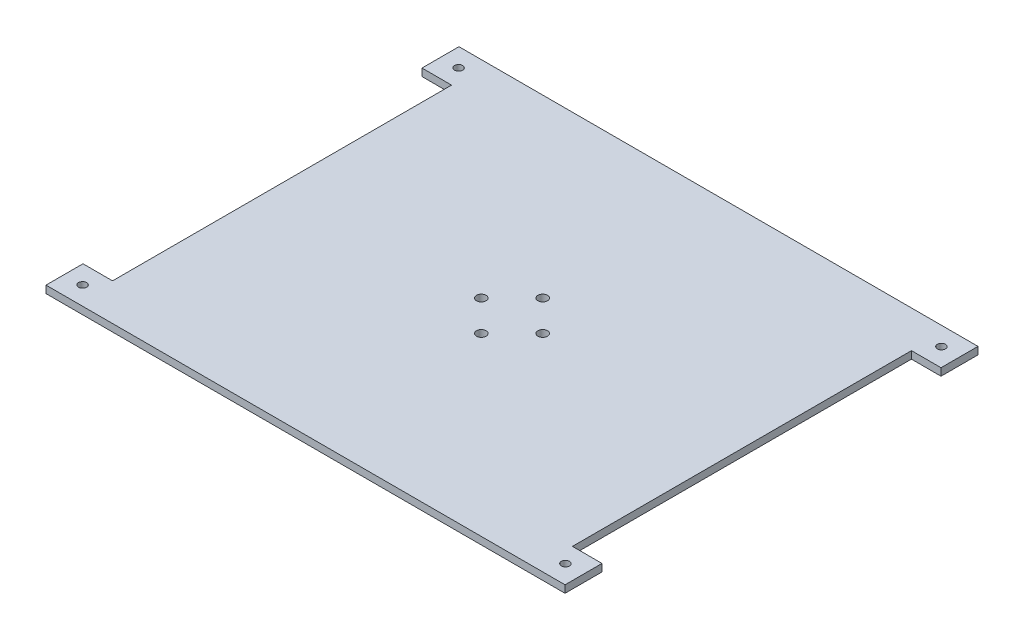
ISO-10303-21;
HEADER;
FILE_DESCRIPTION(('STEP AP214'),'2;1');
FILE_NAME('part.step','',(''),(''),'','','');
FILE_SCHEMA(('AUTOMOTIVE_DESIGN { 1 0 10303 214 1 1 1 1 }'));
ENDSEC;
DATA;
#1=APPLICATION_CONTEXT('core data for automotive mechanical design processes');
#2=APPLICATION_PROTOCOL_DEFINITION('international standard','automotive_design',2000,#1);
#3=PRODUCT_CONTEXT('',#1,'mechanical');
#4=PRODUCT('Part','Part','',(#3));
#5=PRODUCT_RELATED_PRODUCT_CATEGORY('part','',(#4));
#6=PRODUCT_DEFINITION_FORMATION('','',#4);
#7=PRODUCT_DEFINITION_CONTEXT('part definition',#1,'design');
#8=PRODUCT_DEFINITION('design','',#6,#7);
#9=PRODUCT_DEFINITION_SHAPE('','',#8);
#10=(LENGTH_UNIT() NAMED_UNIT(*) SI_UNIT(.MILLI.,.METRE.));
#11=(NAMED_UNIT(*) PLANE_ANGLE_UNIT() SI_UNIT($,.RADIAN.));
#12=(NAMED_UNIT(*) SI_UNIT($,.STERADIAN.) SOLID_ANGLE_UNIT());
#13=UNCERTAINTY_MEASURE_WITH_UNIT(LENGTH_MEASURE(1.E-05),#10,'distance_accuracy_value','');
#14=(GEOMETRIC_REPRESENTATION_CONTEXT(3) GLOBAL_UNCERTAINTY_ASSIGNED_CONTEXT((#13)) GLOBAL_UNIT_ASSIGNED_CONTEXT((#10,
#11,#12)) REPRESENTATION_CONTEXT('',''));
#15=CARTESIAN_POINT('',(0.,0.,0.));
#16=DIRECTION('',(0.,0.,1.));
#17=DIRECTION('',(1.,0.,0.));
#18=AXIS2_PLACEMENT_3D('',#15,#16,#17);
#19=CARTESIAN_POINT('',(-53.7491392552572,2.,-17.4463689814079));
#20=DIRECTION('',(1.,0.,0.));
#21=DIRECTION('',(0.,0.,-1.));
#22=AXIS2_PLACEMENT_3D('',#19,#20,#21);
#23=PLANE('',#22);
#24=DIRECTION('',(0.,0.,1.));
#25=VECTOR('',#24,1.);
#26=CARTESIAN_POINT('',(-53.7491392552572,0.,-17.4463689814079));
#27=LINE('',#26,#25);
#28=CARTESIAN_POINT('',(-53.7491392552572,0.,-27.4463689814079));
#29=VERTEX_POINT('',#28);
#30=CARTESIAN_POINT('',(-53.7491392552572,0.,-17.4463689814079));
#31=VERTEX_POINT('',#30);
#32=EDGE_CURVE('E155',#29,#31,#27,.T.);
#33=ORIENTED_EDGE('',*,*,#32,.T.);
#34=DIRECTION('',(0.,-1.,0.));
#35=VECTOR('',#34,1.);
#36=CARTESIAN_POINT('',(-53.7491392552572,2.,-17.4463689814079));
#37=LINE('',#36,#35);
#38=CARTESIAN_POINT('',(-53.7491392552572,2.,-17.4463689814079));
#39=VERTEX_POINT('',#38);
#40=EDGE_CURVE('E11',#39,#31,#37,.T.);
#41=ORIENTED_EDGE('',*,*,#40,.F.);
#42=DIRECTION('',(0.,0.,1.));
#43=VECTOR('',#42,1.);
#44=CARTESIAN_POINT('',(-53.7491392552572,2.,-17.4463689814079));
#45=LINE('',#44,#43);
#46=CARTESIAN_POINT('',(-53.7491392552572,2.,-27.4463689814079));
#47=VERTEX_POINT('',#46);
#48=EDGE_CURVE('E178',#47,#39,#45,.T.);
#49=ORIENTED_EDGE('',*,*,#48,.F.);
#50=DIRECTION('',(0.,-1.,0.));
#51=VECTOR('',#50,1.);
#52=CARTESIAN_POINT('',(-53.7491392552572,2.,-27.4463689814079));
#53=LINE('',#52,#51);
#54=EDGE_CURVE('E151',#47,#29,#53,.T.);
#55=ORIENTED_EDGE('',*,*,#54,.T.);
#56=EDGE_LOOP('',(#33,#41,#49,#55));
#57=FACE_BOUND('',#56,.T.);
#58=ADVANCED_FACE('F35',(#57),#23,.F.);
#59=CARTESIAN_POINT('',(-53.7491392552572,2.,-17.4463689814079));
#60=DIRECTION('',(0.,0.,-1.));
#61=DIRECTION('',(-1.,0.,0.));
#62=AXIS2_PLACEMENT_3D('',#59,#60,#61);
#63=PLANE('',#62);
#64=DIRECTION('',(1.,0.,0.));
#65=VECTOR('',#64,1.);
#66=CARTESIAN_POINT('',(-53.7491392552572,0.,-17.4463689814079));
#67=LINE('',#66,#65);
#68=CARTESIAN_POINT('',(-45.7491392552572,0.,-17.4463689814079));
#69=VERTEX_POINT('',#68);
#70=EDGE_CURVE('E158',#31,#69,#67,.T.);
#71=ORIENTED_EDGE('',*,*,#70,.T.);
#72=DIRECTION('',(0.,-1.,0.));
#73=VECTOR('',#72,1.);
#74=CARTESIAN_POINT('',(-45.7491392552572,2.,-17.4463689814079));
#75=LINE('',#74,#73);
#76=CARTESIAN_POINT('',(-45.7491392552572,2.,-17.4463689814079));
#77=VERTEX_POINT('',#76);
#78=EDGE_CURVE('E43',#77,#69,#75,.T.);
#79=ORIENTED_EDGE('',*,*,#78,.F.);
#80=DIRECTION('',(1.,0.,0.));
#81=VECTOR('',#80,1.);
#82=CARTESIAN_POINT('',(-53.7491392552572,2.,-17.4463689814079));
#83=LINE('',#82,#81);
#84=EDGE_CURVE('E106',#39,#77,#83,.T.);
#85=ORIENTED_EDGE('',*,*,#84,.F.);
#86=ORIENTED_EDGE('',*,*,#40,.T.);
#87=EDGE_LOOP('',(#71,#79,#85,#86));
#88=FACE_BOUND('',#87,.T.);
#89=ADVANCED_FACE('F257',(#88),#63,.F.);
#90=CARTESIAN_POINT('',(-45.7491392552572,2.,-17.4463689814079));
#91=DIRECTION('',(1.,0.,0.));
#92=DIRECTION('',(0.,0.,-1.));
#93=AXIS2_PLACEMENT_3D('',#90,#91,#92);
#94=PLANE('',#93);
#95=DIRECTION('',(0.,0.,1.));
#96=VECTOR('',#95,1.);
#97=CARTESIAN_POINT('',(-45.7491392552572,0.,-17.4463689814079));
#98=LINE('',#97,#96);
#99=CARTESIAN_POINT('',(-45.7491392552572,0.,74.2536310185921));
#100=VERTEX_POINT('',#99);
#101=EDGE_CURVE('E161',#69,#100,#98,.T.);
#102=ORIENTED_EDGE('',*,*,#101,.T.);
#103=DIRECTION('',(0.,-1.,0.));
#104=VECTOR('',#103,1.);
#105=CARTESIAN_POINT('',(-45.7491392552572,2.,74.2536310185921));
#106=LINE('',#105,#104);
#107=CARTESIAN_POINT('',(-45.7491392552572,2.,74.2536310185921));
#108=VERTEX_POINT('',#107);
#109=EDGE_CURVE('E197',#108,#100,#106,.T.);
#110=ORIENTED_EDGE('',*,*,#109,.F.);
#111=DIRECTION('',(0.,0.,1.));
#112=VECTOR('',#111,1.);
#113=CARTESIAN_POINT('',(-45.7491392552572,2.,-17.4463689814079));
#114=LINE('',#113,#112);
#115=EDGE_CURVE('E205',#77,#108,#114,.T.);
#116=ORIENTED_EDGE('',*,*,#115,.F.);
#117=ORIENTED_EDGE('',*,*,#78,.T.);
#118=EDGE_LOOP('',(#102,#110,#116,#117));
#119=FACE_BOUND('',#118,.T.);
#120=ADVANCED_FACE('F203',(#119),#94,.F.);
#121=CARTESIAN_POINT('',(-45.7491392552572,2.,74.2536310185921));
#122=DIRECTION('',(0.,0.,1.));
#123=DIRECTION('',(1.,0.,0.));
#124=AXIS2_PLACEMENT_3D('',#121,#122,#123);
#125=PLANE('',#124);
#126=DIRECTION('',(-1.,0.,0.));
#127=VECTOR('',#126,1.);
#128=CARTESIAN_POINT('',(-45.7491392552572,0.,74.2536310185921));
#129=LINE('',#128,#127);
#130=CARTESIAN_POINT('',(-53.7491392552572,0.,74.2536310185921));
#131=VERTEX_POINT('',#130);
#132=EDGE_CURVE('E163',#100,#131,#129,.T.);
#133=ORIENTED_EDGE('',*,*,#132,.T.);
#134=DIRECTION('',(0.,-1.,0.));
#135=VECTOR('',#134,1.);
#136=CARTESIAN_POINT('',(-53.7491392552572,2.,74.2536310185921));
#137=LINE('',#136,#135);
#138=CARTESIAN_POINT('',(-53.7491392552572,2.,74.2536310185921));
#139=VERTEX_POINT('',#138);
#140=EDGE_CURVE('E194',#139,#131,#137,.T.);
#141=ORIENTED_EDGE('',*,*,#140,.F.);
#142=DIRECTION('',(-1.,0.,0.));
#143=VECTOR('',#142,1.);
#144=CARTESIAN_POINT('',(-45.7491392552572,2.,74.2536310185921));
#145=LINE('',#144,#143);
#146=EDGE_CURVE('E223',#108,#139,#145,.T.);
#147=ORIENTED_EDGE('',*,*,#146,.F.);
#148=ORIENTED_EDGE('',*,*,#109,.T.);
#149=EDGE_LOOP('',(#133,#141,#147,#148));
#150=FACE_BOUND('',#149,.T.);
#151=ADVANCED_FACE('F214',(#150),#125,.F.);
#152=CARTESIAN_POINT('',(-53.7491392552572,2.,74.2536310185921));
#153=DIRECTION('',(1.,0.,0.));
#154=DIRECTION('',(0.,0.,-1.));
#155=AXIS2_PLACEMENT_3D('',#152,#153,#154);
#156=PLANE('',#155);
#157=DIRECTION('',(0.,0.,1.));
#158=VECTOR('',#157,1.);
#159=CARTESIAN_POINT('',(-53.7491392552572,0.,74.2536310185921));
#160=LINE('',#159,#158);
#161=CARTESIAN_POINT('',(-53.7491392552572,0.,84.2536310185921));
#162=VERTEX_POINT('',#161);
#163=EDGE_CURVE('E165',#131,#162,#160,.T.);
#164=ORIENTED_EDGE('',*,*,#163,.T.);
#165=DIRECTION('',(0.,-1.,0.));
#166=VECTOR('',#165,1.);
#167=CARTESIAN_POINT('',(-53.7491392552572,2.,84.2536310185921));
#168=LINE('',#167,#166);
#169=CARTESIAN_POINT('',(-53.7491392552572,2.,84.2536310185921));
#170=VERTEX_POINT('',#169);
#171=EDGE_CURVE('E191',#170,#162,#168,.T.);
#172=ORIENTED_EDGE('',*,*,#171,.F.);
#173=DIRECTION('',(0.,0.,1.));
#174=VECTOR('',#173,1.);
#175=CARTESIAN_POINT('',(-53.7491392552572,2.,74.2536310185921));
#176=LINE('',#175,#174);
#177=EDGE_CURVE('E220',#139,#170,#176,.T.);
#178=ORIENTED_EDGE('',*,*,#177,.F.);
#179=ORIENTED_EDGE('',*,*,#140,.T.);
#180=EDGE_LOOP('',(#164,#172,#178,#179));
#181=FACE_BOUND('',#180,.T.);
#182=ADVANCED_FACE('F218',(#181),#156,.F.);
#183=CARTESIAN_POINT('',(-53.7491392552572,2.,84.2536310185921));
#184=DIRECTION('',(0.,0.,-1.));
#185=DIRECTION('',(-1.,0.,0.));
#186=AXIS2_PLACEMENT_3D('',#183,#184,#185);
#187=PLANE('',#186);
#188=DIRECTION('',(1.,0.,0.));
#189=VECTOR('',#188,1.);
#190=CARTESIAN_POINT('',(-53.7491392552572,0.,84.2536310185921));
#191=LINE('',#190,#189);
#192=CARTESIAN_POINT('',(86.6508607447428,0.,84.2536310185921));
#193=VERTEX_POINT('',#192);
#194=EDGE_CURVE('E167',#162,#193,#191,.T.);
#195=ORIENTED_EDGE('',*,*,#194,.T.);
#196=DIRECTION('',(0.,-1.,0.));
#197=VECTOR('',#196,1.);
#198=CARTESIAN_POINT('',(86.6508607447428,2.,84.2536310185921));
#199=LINE('',#198,#197);
#200=CARTESIAN_POINT('',(86.6508607447428,2.,84.2536310185921));
#201=VERTEX_POINT('',#200);
#202=EDGE_CURVE('E188',#201,#193,#199,.T.);
#203=ORIENTED_EDGE('',*,*,#202,.F.);
#204=DIRECTION('',(1.,0.,0.));
#205=VECTOR('',#204,1.);
#206=CARTESIAN_POINT('',(-53.7491392552572,2.,84.2536310185921));
#207=LINE('',#206,#205);
#208=EDGE_CURVE('E222',#170,#201,#207,.T.);
#209=ORIENTED_EDGE('',*,*,#208,.F.);
#210=ORIENTED_EDGE('',*,*,#171,.T.);
#211=EDGE_LOOP('',(#195,#203,#209,#210));
#212=FACE_BOUND('',#211,.T.);
#213=ADVANCED_FACE('F270',(#212),#187,.F.);
#214=CARTESIAN_POINT('',(86.6508607447428,2.,84.2536310185921));
#215=DIRECTION('',(-1.,0.,0.));
#216=DIRECTION('',(0.,0.,1.));
#217=AXIS2_PLACEMENT_3D('',#214,#215,#216);
#218=PLANE('',#217);
#219=DIRECTION('',(0.,0.,-1.));
#220=VECTOR('',#219,1.);
#221=CARTESIAN_POINT('',(86.6508607447428,0.,84.2536310185921));
#222=LINE('',#221,#220);
#223=CARTESIAN_POINT('',(86.6508607447428,0.,74.2536310185921));
#224=VERTEX_POINT('',#223);
#225=EDGE_CURVE('E169',#193,#224,#222,.T.);
#226=ORIENTED_EDGE('',*,*,#225,.T.);
#227=DIRECTION('',(0.,-1.,0.));
#228=VECTOR('',#227,1.);
#229=CARTESIAN_POINT('',(86.6508607447428,2.,74.2536310185921));
#230=LINE('',#229,#228);
#231=CARTESIAN_POINT('',(86.6508607447428,2.,74.2536310185921));
#232=VERTEX_POINT('',#231);
#233=EDGE_CURVE('E185',#232,#224,#230,.T.);
#234=ORIENTED_EDGE('',*,*,#233,.F.);
#235=DIRECTION('',(0.,0.,-1.));
#236=VECTOR('',#235,1.);
#237=CARTESIAN_POINT('',(86.6508607447428,2.,84.2536310185921));
#238=LINE('',#237,#236);
#239=EDGE_CURVE('E225',#201,#232,#238,.T.);
#240=ORIENTED_EDGE('',*,*,#239,.F.);
#241=ORIENTED_EDGE('',*,*,#202,.T.);
#242=EDGE_LOOP('',(#226,#234,#240,#241));
#243=FACE_BOUND('',#242,.T.);
#244=ADVANCED_FACE('F273',(#243),#218,.F.);
#245=CARTESIAN_POINT('',(78.6508607447428,2.,74.2536310185921));
#246=DIRECTION('',(0.,0.,1.));
#247=DIRECTION('',(1.,0.,0.));
#248=AXIS2_PLACEMENT_3D('',#245,#246,#247);
#249=PLANE('',#248);
#250=DIRECTION('',(-1.,0.,0.));
#251=VECTOR('',#250,1.);
#252=CARTESIAN_POINT('',(78.6508607447428,0.,74.2536310185921));
#253=LINE('',#252,#251);
#254=CARTESIAN_POINT('',(78.6508607447428,0.,74.2536310185921));
#255=VERTEX_POINT('',#254);
#256=EDGE_CURVE('E171',#224,#255,#253,.T.);
#257=ORIENTED_EDGE('',*,*,#256,.T.);
#258=DIRECTION('',(0.,-1.,0.));
#259=VECTOR('',#258,1.);
#260=CARTESIAN_POINT('',(78.6508607447428,2.,74.2536310185921));
#261=LINE('',#260,#259);
#262=CARTESIAN_POINT('',(78.6508607447428,2.,74.2536310185921));
#263=VERTEX_POINT('',#262);
#264=EDGE_CURVE('E182',#263,#255,#261,.T.);
#265=ORIENTED_EDGE('',*,*,#264,.F.);
#266=DIRECTION('',(-1.,0.,0.));
#267=VECTOR('',#266,1.);
#268=CARTESIAN_POINT('',(78.6508607447428,2.,74.2536310185921));
#269=LINE('',#268,#267);
#270=EDGE_CURVE('E231',#232,#263,#269,.T.);
#271=ORIENTED_EDGE('',*,*,#270,.F.);
#272=ORIENTED_EDGE('',*,*,#233,.T.);
#273=EDGE_LOOP('',(#257,#265,#271,#272));
#274=FACE_BOUND('',#273,.T.);
#275=ADVANCED_FACE('F237',(#274),#249,.F.);
#276=CARTESIAN_POINT('',(78.6508607447428,2.,-17.4463689814079));
#277=DIRECTION('',(-1.,0.,0.));
#278=DIRECTION('',(0.,0.,1.));
#279=AXIS2_PLACEMENT_3D('',#276,#277,#278);
#280=PLANE('',#279);
#281=DIRECTION('',(0.,0.,-1.));
#282=VECTOR('',#281,1.);
#283=CARTESIAN_POINT('',(78.6508607447428,0.,-17.4463689814079));
#284=LINE('',#283,#282);
#285=CARTESIAN_POINT('',(78.6508607447428,0.,-17.4463689814079));
#286=VERTEX_POINT('',#285);
#287=EDGE_CURVE('E173',#255,#286,#284,.T.);
#288=ORIENTED_EDGE('',*,*,#287,.T.);
#289=DIRECTION('',(0.,-1.,0.));
#290=VECTOR('',#289,1.);
#291=CARTESIAN_POINT('',(78.6508607447428,2.,-17.4463689814079));
#292=LINE('',#291,#290);
#293=CARTESIAN_POINT('',(78.6508607447428,2.,-17.4463689814079));
#294=VERTEX_POINT('',#293);
#295=EDGE_CURVE('E146',#294,#286,#292,.T.);
#296=ORIENTED_EDGE('',*,*,#295,.F.);
#297=DIRECTION('',(0.,0.,-1.));
#298=VECTOR('',#297,1.);
#299=CARTESIAN_POINT('',(78.6508607447428,2.,-17.4463689814079));
#300=LINE('',#299,#298);
#301=EDGE_CURVE('E137',#263,#294,#300,.T.);
#302=ORIENTED_EDGE('',*,*,#301,.F.);
#303=ORIENTED_EDGE('',*,*,#264,.T.);
#304=EDGE_LOOP('',(#288,#296,#302,#303));
#305=FACE_BOUND('',#304,.T.);
#306=ADVANCED_FACE('F241',(#305),#280,.F.);
#307=CARTESIAN_POINT('',(78.6508607447428,2.,-17.4463689814079));
#308=DIRECTION('',(0.,0.,-1.));
#309=DIRECTION('',(-1.,0.,0.));
#310=AXIS2_PLACEMENT_3D('',#307,#308,#309);
#311=PLANE('',#310);
#312=DIRECTION('',(1.,0.,0.));
#313=VECTOR('',#312,1.);
#314=CARTESIAN_POINT('',(78.6508607447428,0.,-17.4463689814079));
#315=LINE('',#314,#313);
#316=CARTESIAN_POINT('',(86.6508607447428,0.,-17.4463689814079));
#317=VERTEX_POINT('',#316);
#318=EDGE_CURVE('E145',#286,#317,#315,.T.);
#319=ORIENTED_EDGE('',*,*,#318,.T.);
#320=DIRECTION('',(0.,-1.,0.));
#321=VECTOR('',#320,1.);
#322=CARTESIAN_POINT('',(86.6508607447428,2.,-17.4463689814079));
#323=LINE('',#322,#321);
#324=CARTESIAN_POINT('',(86.6508607447428,2.,-17.4463689814079));
#325=VERTEX_POINT('',#324);
#326=EDGE_CURVE('E142',#325,#317,#323,.T.);
#327=ORIENTED_EDGE('',*,*,#326,.F.);
#328=DIRECTION('',(1.,0.,0.));
#329=VECTOR('',#328,1.);
#330=CARTESIAN_POINT('',(78.6508607447428,2.,-17.4463689814079));
#331=LINE('',#330,#329);
#332=EDGE_CURVE('E131',#294,#325,#331,.T.);
#333=ORIENTED_EDGE('',*,*,#332,.F.);
#334=ORIENTED_EDGE('',*,*,#295,.T.);
#335=EDGE_LOOP('',(#319,#327,#333,#334));
#336=FACE_BOUND('',#335,.T.);
#337=ADVANCED_FACE('F143',(#336),#311,.F.);
#338=CARTESIAN_POINT('',(86.6508607447428,2.,-17.4463689814079));
#339=DIRECTION('',(-1.,0.,0.));
#340=DIRECTION('',(0.,0.,1.));
#341=AXIS2_PLACEMENT_3D('',#338,#339,#340);
#342=PLANE('',#341);
#343=DIRECTION('',(0.,0.,-1.));
#344=VECTOR('',#343,1.);
#345=CARTESIAN_POINT('',(86.6508607447428,0.,-17.4463689814079));
#346=LINE('',#345,#344);
#347=CARTESIAN_POINT('',(86.6508607447428,0.,-27.4463689814079));
#348=VERTEX_POINT('',#347);
#349=EDGE_CURVE('E92',#317,#348,#346,.T.);
#350=ORIENTED_EDGE('',*,*,#349,.T.);
#351=DIRECTION('',(0.,-1.,0.));
#352=VECTOR('',#351,1.);
#353=CARTESIAN_POINT('',(86.6508607447428,2.,-27.4463689814079));
#354=LINE('',#353,#352);
#355=CARTESIAN_POINT('',(86.6508607447428,2.,-27.4463689814079));
#356=VERTEX_POINT('',#355);
#357=EDGE_CURVE('E147',#356,#348,#354,.T.);
#358=ORIENTED_EDGE('',*,*,#357,.F.);
#359=DIRECTION('',(0.,0.,-1.));
#360=VECTOR('',#359,1.);
#361=CARTESIAN_POINT('',(86.6508607447428,2.,-17.4463689814079));
#362=LINE('',#361,#360);
#363=EDGE_CURVE('E135',#325,#356,#362,.T.);
#364=ORIENTED_EDGE('',*,*,#363,.F.);
#365=ORIENTED_EDGE('',*,*,#326,.T.);
#366=EDGE_LOOP('',(#350,#358,#364,#365));
#367=FACE_BOUND('',#366,.T.);
#368=ADVANCED_FACE('F149',(#367),#342,.F.);
#369=CARTESIAN_POINT('',(-53.7491392552572,2.,-27.4463689814079));
#370=DIRECTION('',(0.,0.,1.));
#371=DIRECTION('',(1.,0.,0.));
#372=AXIS2_PLACEMENT_3D('',#369,#370,#371);
#373=PLANE('',#372);
#374=DIRECTION('',(-1.,0.,0.));
#375=VECTOR('',#374,1.);
#376=CARTESIAN_POINT('',(-53.7491392552572,0.,-27.4463689814079));
#377=LINE('',#376,#375);
#378=EDGE_CURVE('E98',#348,#29,#377,.T.);
#379=ORIENTED_EDGE('',*,*,#378,.T.);
#380=ORIENTED_EDGE('',*,*,#54,.F.);
#381=DIRECTION('',(-1.,0.,0.));
#382=VECTOR('',#381,1.);
#383=CARTESIAN_POINT('',(-53.7491392552572,2.,-27.4463689814079));
#384=LINE('',#383,#382);
#385=EDGE_CURVE('E51',#356,#47,#384,.T.);
#386=ORIENTED_EDGE('',*,*,#385,.F.);
#387=ORIENTED_EDGE('',*,*,#357,.T.);
#388=EDGE_LOOP('',(#379,#380,#386,#387));
#389=FACE_BOUND('',#388,.T.);
#390=ADVANCED_FACE('F245',(#389),#373,.F.);
#391=CARTESIAN_POINT('',(0.,2.,0.));
#392=DIRECTION('',(0.,-1.,0.));
#393=DIRECTION('',(0.,0.,-1.));
#394=AXIS2_PLACEMENT_3D('',#391,#392,#393);
#395=PLANE('',#394);
#396=CARTESIAN_POINT('',(16.4508607447428,2.,20.1036310185921));
#397=DIRECTION('',(0.,1.,0.));
#398=DIRECTION('',(0.,0.,1.));
#399=AXIS2_PLACEMENT_3D('',#396,#397,#398);
#400=CIRCLE('',#399,1.3);
#401=CARTESIAN_POINT('',(16.4508607447428,2.,21.4036310185921));
#402=VERTEX_POINT('',#401);
#403=EDGE_CURVE('E399',#402,#402,#400,.T.);
#404=ORIENTED_EDGE('',*,*,#403,.F.);
#405=EDGE_LOOP('',(#404));
#406=FACE_BOUND('',#405,.T.);
#407=CARTESIAN_POINT('',(24.7508607447428,2.,28.4036310185921));
#408=DIRECTION('',(0.,1.,0.));
#409=DIRECTION('',(0.,0.,1.));
#410=AXIS2_PLACEMENT_3D('',#407,#408,#409);
#411=CIRCLE('',#410,1.3);
#412=CARTESIAN_POINT('',(24.7508607447428,2.,29.7036310185921));
#413=VERTEX_POINT('',#412);
#414=EDGE_CURVE('E401',#413,#413,#411,.T.);
#415=ORIENTED_EDGE('',*,*,#414,.F.);
#416=EDGE_LOOP('',(#415));
#417=FACE_BOUND('',#416,.T.);
#418=CARTESIAN_POINT('',(16.4508607447428,2.,36.7036310185921));
#419=DIRECTION('',(0.,1.,0.));
#420=DIRECTION('',(0.,0.,1.));
#421=AXIS2_PLACEMENT_3D('',#418,#419,#420);
#422=CIRCLE('',#421,1.3);
#423=CARTESIAN_POINT('',(16.4508607447428,2.,38.0036310185921));
#424=VERTEX_POINT('',#423);
#425=EDGE_CURVE('E407',#424,#424,#422,.T.);
#426=ORIENTED_EDGE('',*,*,#425,.F.);
#427=EDGE_LOOP('',(#426));
#428=FACE_BOUND('',#427,.T.);
#429=CARTESIAN_POINT('',(8.15086074474283,2.,28.4036310185921));
#430=DIRECTION('',(0.,1.,0.));
#431=DIRECTION('',(0.,0.,1.));
#432=AXIS2_PLACEMENT_3D('',#429,#430,#431);
#433=CIRCLE('',#432,1.3);
#434=CARTESIAN_POINT('',(8.15086074474283,2.,29.7036310185921));
#435=VERTEX_POINT('',#434);
#436=EDGE_CURVE('E413',#435,#435,#433,.T.);
#437=ORIENTED_EDGE('',*,*,#436,.F.);
#438=EDGE_LOOP('',(#437));
#439=FACE_BOUND('',#438,.T.);
#440=CARTESIAN_POINT('',(81.7508607447428,2.,79.2536310185921));
#441=DIRECTION('',(0.,1.,0.));
#442=DIRECTION('',(0.,0.,1.));
#443=AXIS2_PLACEMENT_3D('',#440,#441,#442);
#444=CIRCLE('',#443,1.10000000000001);
#445=CARTESIAN_POINT('',(81.7508607447428,2.,80.3536310185921));
#446=VERTEX_POINT('',#445);
#447=EDGE_CURVE('E419',#446,#446,#444,.T.);
#448=ORIENTED_EDGE('',*,*,#447,.F.);
#449=EDGE_LOOP('',(#448));
#450=FACE_BOUND('',#449,.T.);
#451=CARTESIAN_POINT('',(81.7508607447428,2.,-22.4463689814079));
#452=DIRECTION('',(0.,1.,0.));
#453=DIRECTION('',(0.,0.,1.));
#454=AXIS2_PLACEMENT_3D('',#451,#452,#453);
#455=CIRCLE('',#454,1.10000000000001);
#456=CARTESIAN_POINT('',(81.7508607447428,2.,-21.3463689814079));
#457=VERTEX_POINT('',#456);
#458=EDGE_CURVE('E425',#457,#457,#455,.T.);
#459=ORIENTED_EDGE('',*,*,#458,.F.);
#460=EDGE_LOOP('',(#459));
#461=FACE_BOUND('',#460,.T.);
#462=CARTESIAN_POINT('',(-48.8491392552572,2.,-22.4463689814079));
#463=DIRECTION('',(0.,1.,0.));
#464=DIRECTION('',(0.,0.,1.));
#465=AXIS2_PLACEMENT_3D('',#462,#463,#464);
#466=CIRCLE('',#465,1.1);
#467=CARTESIAN_POINT('',(-48.8491392552572,2.,-21.3463689814079));
#468=VERTEX_POINT('',#467);
#469=EDGE_CURVE('E431',#468,#468,#466,.T.);
#470=ORIENTED_EDGE('',*,*,#469,.F.);
#471=EDGE_LOOP('',(#470));
#472=FACE_BOUND('',#471,.T.);
#473=CARTESIAN_POINT('',(-48.8491392552572,2.,79.2536310185921));
#474=DIRECTION('',(0.,1.,0.));
#475=DIRECTION('',(0.,0.,1.));
#476=AXIS2_PLACEMENT_3D('',#473,#474,#475);
#477=CIRCLE('',#476,1.1);
#478=CARTESIAN_POINT('',(-48.8491392552572,2.,80.3536310185921));
#479=VERTEX_POINT('',#478);
#480=EDGE_CURVE('E437',#479,#479,#477,.T.);
#481=ORIENTED_EDGE('',*,*,#480,.F.);
#482=EDGE_LOOP('',(#481));
#483=FACE_BOUND('',#482,.T.);
#484=ORIENTED_EDGE('',*,*,#48,.T.);
#485=ORIENTED_EDGE('',*,*,#84,.T.);
#486=ORIENTED_EDGE('',*,*,#115,.T.);
#487=ORIENTED_EDGE('',*,*,#146,.T.);
#488=ORIENTED_EDGE('',*,*,#177,.T.);
#489=ORIENTED_EDGE('',*,*,#208,.T.);
#490=ORIENTED_EDGE('',*,*,#239,.T.);
#491=ORIENTED_EDGE('',*,*,#270,.T.);
#492=ORIENTED_EDGE('',*,*,#301,.T.);
#493=ORIENTED_EDGE('',*,*,#332,.T.);
#494=ORIENTED_EDGE('',*,*,#363,.T.);
#495=ORIENTED_EDGE('',*,*,#385,.T.);
#496=EDGE_LOOP('',(#484,#485,#486,#487,#488,#489,#490,#491,#492,#493,#494,#495));
#497=FACE_BOUND('',#496,.T.);
#498=ADVANCED_FACE('F133',(#406,#417,#428,#439,#450,#461,#472,#483,#497),#395,.F.);
#499=CARTESIAN_POINT('',(0.,0.,0.));
#500=DIRECTION('',(0.,-1.,0.));
#501=DIRECTION('',(0.,0.,-1.));
#502=AXIS2_PLACEMENT_3D('',#499,#500,#501);
#503=PLANE('',#502);
#504=CARTESIAN_POINT('',(16.4508607447428,0.,20.1036310185921));
#505=DIRECTION('',(0.,1.,0.));
#506=DIRECTION('',(0.,0.,1.));
#507=AXIS2_PLACEMENT_3D('',#504,#505,#506);
#508=CIRCLE('',#507,1.3);
#509=CARTESIAN_POINT('',(16.4508607447428,0.,21.4036310185921));
#510=VERTEX_POINT('',#509);
#511=EDGE_CURVE('E396',#510,#510,#508,.T.);
#512=ORIENTED_EDGE('',*,*,#511,.T.);
#513=EDGE_LOOP('',(#512));
#514=FACE_BOUND('',#513,.T.);
#515=CARTESIAN_POINT('',(24.7508607447428,0.,28.4036310185921));
#516=DIRECTION('',(0.,1.,0.));
#517=DIRECTION('',(0.,0.,1.));
#518=AXIS2_PLACEMENT_3D('',#515,#516,#517);
#519=CIRCLE('',#518,1.3);
#520=CARTESIAN_POINT('',(24.7508607447428,0.,29.7036310185921));
#521=VERTEX_POINT('',#520);
#522=EDGE_CURVE('E404',#521,#521,#519,.T.);
#523=ORIENTED_EDGE('',*,*,#522,.T.);
#524=EDGE_LOOP('',(#523));
#525=FACE_BOUND('',#524,.T.);
#526=CARTESIAN_POINT('',(16.4508607447428,0.,36.7036310185921));
#527=DIRECTION('',(0.,1.,0.));
#528=DIRECTION('',(0.,0.,1.));
#529=AXIS2_PLACEMENT_3D('',#526,#527,#528);
#530=CIRCLE('',#529,1.3);
#531=CARTESIAN_POINT('',(16.4508607447428,0.,38.0036310185921));
#532=VERTEX_POINT('',#531);
#533=EDGE_CURVE('E410',#532,#532,#530,.T.);
#534=ORIENTED_EDGE('',*,*,#533,.T.);
#535=EDGE_LOOP('',(#534));
#536=FACE_BOUND('',#535,.T.);
#537=CARTESIAN_POINT('',(8.15086074474283,0.,28.4036310185921));
#538=DIRECTION('',(0.,1.,0.));
#539=DIRECTION('',(0.,0.,1.));
#540=AXIS2_PLACEMENT_3D('',#537,#538,#539);
#541=CIRCLE('',#540,1.3);
#542=CARTESIAN_POINT('',(8.15086074474283,0.,29.7036310185921));
#543=VERTEX_POINT('',#542);
#544=EDGE_CURVE('E416',#543,#543,#541,.T.);
#545=ORIENTED_EDGE('',*,*,#544,.T.);
#546=EDGE_LOOP('',(#545));
#547=FACE_BOUND('',#546,.T.);
#548=CARTESIAN_POINT('',(81.7508607447428,0.,79.2536310185921));
#549=DIRECTION('',(0.,1.,0.));
#550=DIRECTION('',(0.,0.,1.));
#551=AXIS2_PLACEMENT_3D('',#548,#549,#550);
#552=CIRCLE('',#551,1.10000000000001);
#553=CARTESIAN_POINT('',(81.7508607447428,0.,80.3536310185921));
#554=VERTEX_POINT('',#553);
#555=EDGE_CURVE('E422',#554,#554,#552,.T.);
#556=ORIENTED_EDGE('',*,*,#555,.T.);
#557=EDGE_LOOP('',(#556));
#558=FACE_BOUND('',#557,.T.);
#559=CARTESIAN_POINT('',(81.7508607447428,0.,-22.4463689814079));
#560=DIRECTION('',(0.,1.,0.));
#561=DIRECTION('',(0.,0.,1.));
#562=AXIS2_PLACEMENT_3D('',#559,#560,#561);
#563=CIRCLE('',#562,1.10000000000001);
#564=CARTESIAN_POINT('',(81.7508607447428,0.,-21.3463689814079));
#565=VERTEX_POINT('',#564);
#566=EDGE_CURVE('E428',#565,#565,#563,.T.);
#567=ORIENTED_EDGE('',*,*,#566,.T.);
#568=EDGE_LOOP('',(#567));
#569=FACE_BOUND('',#568,.T.);
#570=CARTESIAN_POINT('',(-48.8491392552572,0.,-22.4463689814079));
#571=DIRECTION('',(0.,1.,0.));
#572=DIRECTION('',(0.,0.,1.));
#573=AXIS2_PLACEMENT_3D('',#570,#571,#572);
#574=CIRCLE('',#573,1.1);
#575=CARTESIAN_POINT('',(-48.8491392552572,0.,-21.3463689814079));
#576=VERTEX_POINT('',#575);
#577=EDGE_CURVE('E434',#576,#576,#574,.T.);
#578=ORIENTED_EDGE('',*,*,#577,.T.);
#579=EDGE_LOOP('',(#578));
#580=FACE_BOUND('',#579,.T.);
#581=CARTESIAN_POINT('',(-48.8491392552572,0.,79.2536310185921));
#582=DIRECTION('',(0.,1.,0.));
#583=DIRECTION('',(0.,0.,1.));
#584=AXIS2_PLACEMENT_3D('',#581,#582,#583);
#585=CIRCLE('',#584,1.1);
#586=CARTESIAN_POINT('',(-48.8491392552572,0.,80.3536310185921));
#587=VERTEX_POINT('',#586);
#588=EDGE_CURVE('E159',#587,#587,#585,.T.);
#589=ORIENTED_EDGE('',*,*,#588,.T.);
#590=EDGE_LOOP('',(#589));
#591=FACE_BOUND('',#590,.T.);
#592=ORIENTED_EDGE('',*,*,#32,.F.);
#593=ORIENTED_EDGE('',*,*,#378,.F.);
#594=ORIENTED_EDGE('',*,*,#349,.F.);
#595=ORIENTED_EDGE('',*,*,#318,.F.);
#596=ORIENTED_EDGE('',*,*,#287,.F.);
#597=ORIENTED_EDGE('',*,*,#256,.F.);
#598=ORIENTED_EDGE('',*,*,#225,.F.);
#599=ORIENTED_EDGE('',*,*,#194,.F.);
#600=ORIENTED_EDGE('',*,*,#163,.F.);
#601=ORIENTED_EDGE('',*,*,#132,.F.);
#602=ORIENTED_EDGE('',*,*,#101,.F.);
#603=ORIENTED_EDGE('',*,*,#70,.F.);
#604=EDGE_LOOP('',(#592,#593,#594,#595,#596,#597,#598,#599,#600,#601,#602,#603));
#605=FACE_BOUND('',#604,.T.);
#606=ADVANCED_FACE('F209',(#514,#525,#536,#547,#558,#569,#580,#591,#605),#503,.T.);
#607=CARTESIAN_POINT('',(-48.8491392552572,0.,79.2536310185921));
#608=DIRECTION('',(0.,1.,0.));
#609=DIRECTION('',(0.,0.,1.));
#610=AXIS2_PLACEMENT_3D('',#607,#608,#609);
#611=CYLINDRICAL_SURFACE('',#610,1.1);
#612=ORIENTED_EDGE('',*,*,#588,.F.);
#613=EDGE_LOOP('',(#612));
#614=FACE_BOUND('',#613,.T.);
#615=ORIENTED_EDGE('',*,*,#480,.T.);
#616=EDGE_LOOP('',(#615));
#617=FACE_BOUND('',#616,.T.);
#618=ADVANCED_FACE('F301',(#614,#617),#611,.F.);
#619=CARTESIAN_POINT('',(-48.8491392552572,0.,-22.4463689814079));
#620=DIRECTION('',(0.,1.,0.));
#621=DIRECTION('',(0.,0.,1.));
#622=AXIS2_PLACEMENT_3D('',#619,#620,#621);
#623=CYLINDRICAL_SURFACE('',#622,1.1);
#624=ORIENTED_EDGE('',*,*,#577,.F.);
#625=EDGE_LOOP('',(#624));
#626=FACE_BOUND('',#625,.T.);
#627=ORIENTED_EDGE('',*,*,#469,.T.);
#628=EDGE_LOOP('',(#627));
#629=FACE_BOUND('',#628,.T.);
#630=ADVANCED_FACE('F306',(#626,#629),#623,.F.);
#631=CARTESIAN_POINT('',(81.7508607447428,0.,-22.4463689814079));
#632=DIRECTION('',(0.,1.,0.));
#633=DIRECTION('',(0.,0.,1.));
#634=AXIS2_PLACEMENT_3D('',#631,#632,#633);
#635=CYLINDRICAL_SURFACE('',#634,1.10000000000001);
#636=ORIENTED_EDGE('',*,*,#566,.F.);
#637=EDGE_LOOP('',(#636));
#638=FACE_BOUND('',#637,.T.);
#639=ORIENTED_EDGE('',*,*,#458,.T.);
#640=EDGE_LOOP('',(#639));
#641=FACE_BOUND('',#640,.T.);
#642=ADVANCED_FACE('F318',(#638,#641),#635,.F.);
#643=CARTESIAN_POINT('',(81.7508607447428,0.,79.2536310185921));
#644=DIRECTION('',(0.,1.,0.));
#645=DIRECTION('',(0.,0.,1.));
#646=AXIS2_PLACEMENT_3D('',#643,#644,#645);
#647=CYLINDRICAL_SURFACE('',#646,1.10000000000001);
#648=ORIENTED_EDGE('',*,*,#555,.F.);
#649=EDGE_LOOP('',(#648));
#650=FACE_BOUND('',#649,.T.);
#651=ORIENTED_EDGE('',*,*,#447,.T.);
#652=EDGE_LOOP('',(#651));
#653=FACE_BOUND('',#652,.T.);
#654=ADVANCED_FACE('F328',(#650,#653),#647,.F.);
#655=CARTESIAN_POINT('',(8.15086074474283,0.,28.4036310185921));
#656=DIRECTION('',(0.,1.,0.));
#657=DIRECTION('',(0.,0.,1.));
#658=AXIS2_PLACEMENT_3D('',#655,#656,#657);
#659=CYLINDRICAL_SURFACE('',#658,1.3);
#660=ORIENTED_EDGE('',*,*,#544,.F.);
#661=EDGE_LOOP('',(#660));
#662=FACE_BOUND('',#661,.T.);
#663=ORIENTED_EDGE('',*,*,#436,.T.);
#664=EDGE_LOOP('',(#663));
#665=FACE_BOUND('',#664,.T.);
#666=ADVANCED_FACE('F338',(#662,#665),#659,.F.);
#667=CARTESIAN_POINT('',(16.4508607447428,0.,36.7036310185921));
#668=DIRECTION('',(0.,1.,0.));
#669=DIRECTION('',(0.,0.,1.));
#670=AXIS2_PLACEMENT_3D('',#667,#668,#669);
#671=CYLINDRICAL_SURFACE('',#670,1.3);
#672=ORIENTED_EDGE('',*,*,#533,.F.);
#673=EDGE_LOOP('',(#672));
#674=FACE_BOUND('',#673,.T.);
#675=ORIENTED_EDGE('',*,*,#425,.T.);
#676=EDGE_LOOP('',(#675));
#677=FACE_BOUND('',#676,.T.);
#678=ADVANCED_FACE('F359',(#674,#677),#671,.F.);
#679=CARTESIAN_POINT('',(24.7508607447428,0.,28.4036310185921));
#680=DIRECTION('',(0.,1.,0.));
#681=DIRECTION('',(0.,0.,1.));
#682=AXIS2_PLACEMENT_3D('',#679,#680,#681);
#683=CYLINDRICAL_SURFACE('',#682,1.3);
#684=ORIENTED_EDGE('',*,*,#522,.F.);
#685=EDGE_LOOP('',(#684));
#686=FACE_BOUND('',#685,.T.);
#687=ORIENTED_EDGE('',*,*,#414,.T.);
#688=EDGE_LOOP('',(#687));
#689=FACE_BOUND('',#688,.T.);
#690=ADVANCED_FACE('F369',(#686,#689),#683,.F.);
#691=CARTESIAN_POINT('',(16.4508607447428,0.,20.1036310185921));
#692=DIRECTION('',(0.,1.,0.));
#693=DIRECTION('',(0.,0.,1.));
#694=AXIS2_PLACEMENT_3D('',#691,#692,#693);
#695=CYLINDRICAL_SURFACE('',#694,1.3);
#696=ORIENTED_EDGE('',*,*,#511,.F.);
#697=EDGE_LOOP('',(#696));
#698=FACE_BOUND('',#697,.T.);
#699=ORIENTED_EDGE('',*,*,#403,.T.);
#700=EDGE_LOOP('',(#699));
#701=FACE_BOUND('',#700,.T.);
#702=ADVANCED_FACE('F379',(#698,#701),#695,.F.);
#703=CLOSED_SHELL('',(#58,#89,#120,#151,#182,#213,#244,#275,#306,#337,#368,#390,#498,#606,#618,
#630,#642,#654,#666,#678,#690,#702));
#704=MANIFOLD_SOLID_BREP('B2',#703);
#705=ADVANCED_BREP_SHAPE_REPRESENTATION('',(#18,#704),#14);
#706=SHAPE_DEFINITION_REPRESENTATION(#9,#705);
ENDSEC;
END-ISO-10303-21;
